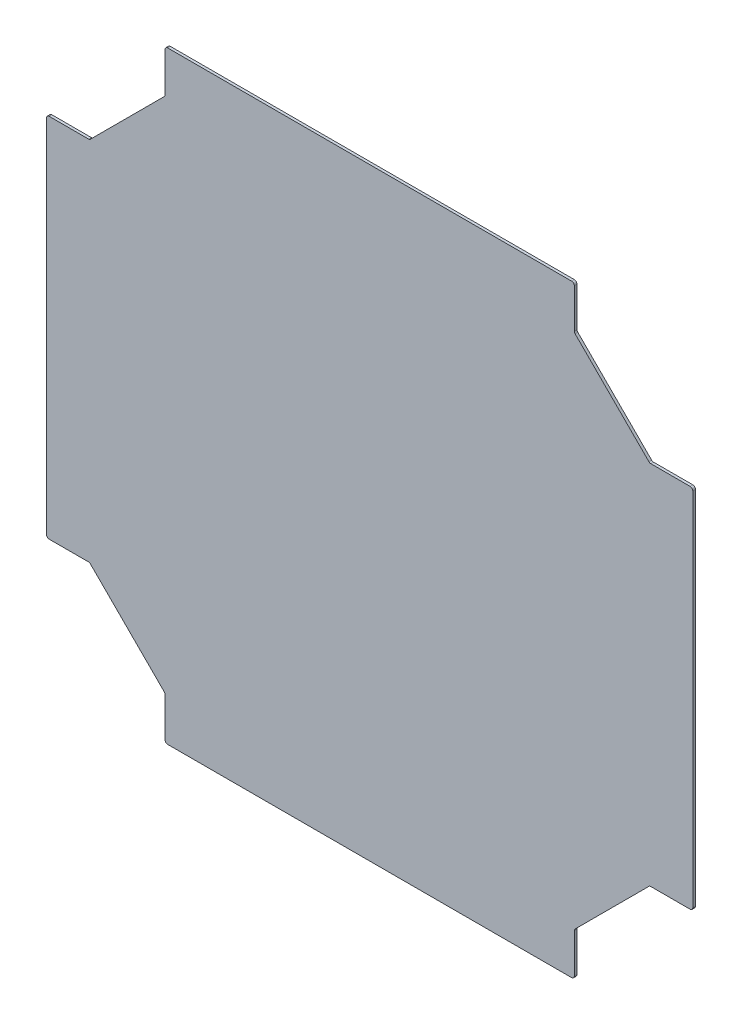
ISO-10303-21;
HEADER;
FILE_DESCRIPTION(('STEP AP214'),'2;1');
FILE_NAME('part.step','',(''),(''),'','','');
FILE_SCHEMA(('AUTOMOTIVE_DESIGN { 1 0 10303 214 1 1 1 1 }'));
ENDSEC;
DATA;
#1=APPLICATION_CONTEXT('core data for automotive mechanical design processes');
#2=APPLICATION_PROTOCOL_DEFINITION('international standard','automotive_design',2000,#1);
#3=PRODUCT_CONTEXT('',#1,'mechanical');
#4=PRODUCT('Part','Part','',(#3));
#5=PRODUCT_RELATED_PRODUCT_CATEGORY('part','',(#4));
#6=PRODUCT_DEFINITION_FORMATION('','',#4);
#7=PRODUCT_DEFINITION_CONTEXT('part definition',#1,'design');
#8=PRODUCT_DEFINITION('design','',#6,#7);
#9=PRODUCT_DEFINITION_SHAPE('','',#8);
#10=(LENGTH_UNIT() NAMED_UNIT(*) SI_UNIT(.MILLI.,.METRE.));
#11=(NAMED_UNIT(*) PLANE_ANGLE_UNIT() SI_UNIT($,.RADIAN.));
#12=(NAMED_UNIT(*) SI_UNIT($,.STERADIAN.) SOLID_ANGLE_UNIT());
#13=UNCERTAINTY_MEASURE_WITH_UNIT(LENGTH_MEASURE(1.E-05),#10,'distance_accuracy_value','');
#14=(GEOMETRIC_REPRESENTATION_CONTEXT(3) GLOBAL_UNCERTAINTY_ASSIGNED_CONTEXT((#13)) GLOBAL_UNIT_ASSIGNED_CONTEXT((#10,
#11,#12)) REPRESENTATION_CONTEXT('',''));
#15=CARTESIAN_POINT('',(0.,0.,0.));
#16=DIRECTION('',(0.,0.,1.));
#17=DIRECTION('',(1.,0.,0.));
#18=AXIS2_PLACEMENT_3D('',#15,#16,#17);
#19=CARTESIAN_POINT('',(0.,0.,3.175));
#20=DIRECTION('',(1.,0.,0.));
#21=DIRECTION('',(0.,0.,-1.));
#22=AXIS2_PLACEMENT_3D('',#19,#20,#21);
#23=PLANE('',#22);
#24=DIRECTION('',(0.,-1.,0.));
#25=VECTOR('',#24,1.);
#26=CARTESIAN_POINT('',(0.,0.,0.));
#27=LINE('',#26,#25);
#28=CARTESIAN_POINT('',(0.,568.325,0.));
#29=VERTEX_POINT('',#28);
#30=CARTESIAN_POINT('',(0.,142.875,0.));
#31=VERTEX_POINT('',#30);
#32=EDGE_CURVE('E247',#29,#31,#27,.T.);
#33=ORIENTED_EDGE('',*,*,#32,.T.);
#34=DIRECTION('',(0.,0.,1.));
#35=VECTOR('',#34,1.);
#36=CARTESIAN_POINT('',(0.,142.875,3.175));
#37=LINE('',#36,#35);
#38=CARTESIAN_POINT('',(0.,142.875,3.175));
#39=VERTEX_POINT('',#38);
#40=EDGE_CURVE('E253',#31,#39,#37,.T.);
#41=ORIENTED_EDGE('',*,*,#40,.T.);
#42=DIRECTION('',(0.,-1.,0.));
#43=VECTOR('',#42,1.);
#44=CARTESIAN_POINT('',(0.,0.,3.175));
#45=LINE('',#44,#43);
#46=CARTESIAN_POINT('',(0.,568.325,3.175));
#47=VERTEX_POINT('',#46);
#48=EDGE_CURVE('E250',#47,#39,#45,.T.);
#49=ORIENTED_EDGE('',*,*,#48,.F.);
#50=DIRECTION('',(0.,0.,1.));
#51=VECTOR('',#50,1.);
#52=CARTESIAN_POINT('',(0.,568.325,3.175));
#53=LINE('',#52,#51);
#54=EDGE_CURVE('E244',#47,#29,#53,.F.);
#55=ORIENTED_EDGE('',*,*,#54,.T.);
#56=EDGE_LOOP('',(#33,#41,#49,#55));
#57=FACE_BOUND('',#56,.T.);
#58=ADVANCED_FACE('F33',(#57),#23,.F.);
#59=CARTESIAN_POINT('',(0.,0.,3.175));
#60=DIRECTION('',(0.,1.,0.));
#61=DIRECTION('',(0.,0.,1.));
#62=AXIS2_PLACEMENT_3D('',#59,#60,#61);
#63=PLANE('',#62);
#64=DIRECTION('',(1.,0.,0.));
#65=VECTOR('',#64,1.);
#66=CARTESIAN_POINT('',(0.,0.,3.175));
#67=LINE('',#66,#65);
#68=CARTESIAN_POINT('',(142.875,0.,3.175));
#69=VERTEX_POINT('',#68);
#70=CARTESIAN_POINT('',(619.125,0.,3.175));
#71=VERTEX_POINT('',#70);
#72=EDGE_CURVE('E439',#69,#71,#67,.T.);
#73=ORIENTED_EDGE('',*,*,#72,.F.);
#74=DIRECTION('',(0.,0.,1.));
#75=VECTOR('',#74,1.);
#76=CARTESIAN_POINT('',(142.875,0.,3.175));
#77=LINE('',#76,#75);
#78=CARTESIAN_POINT('',(142.875,0.,0.));
#79=VERTEX_POINT('',#78);
#80=EDGE_CURVE('E300',#69,#79,#77,.F.);
#81=ORIENTED_EDGE('',*,*,#80,.T.);
#82=DIRECTION('',(1.,0.,0.));
#83=VECTOR('',#82,1.);
#84=CARTESIAN_POINT('',(0.,0.,0.));
#85=LINE('',#84,#83);
#86=CARTESIAN_POINT('',(619.125,0.,0.));
#87=VERTEX_POINT('',#86);
#88=EDGE_CURVE('E263',#79,#87,#85,.T.);
#89=ORIENTED_EDGE('',*,*,#88,.T.);
#90=DIRECTION('',(0.,0.,1.));
#91=VECTOR('',#90,1.);
#92=CARTESIAN_POINT('',(619.125,0.,3.175));
#93=LINE('',#92,#91);
#94=EDGE_CURVE('E297',#87,#71,#93,.T.);
#95=ORIENTED_EDGE('',*,*,#94,.T.);
#96=EDGE_LOOP('',(#73,#81,#89,#95));
#97=FACE_BOUND('',#96,.T.);
#98=ADVANCED_FACE('F523',(#97),#63,.F.);
#99=CARTESIAN_POINT('',(762.,0.,3.175));
#100=DIRECTION('',(-1.,0.,0.));
#101=DIRECTION('',(0.,-1.,0.));
#102=AXIS2_PLACEMENT_3D('',#99,#100,#101);
#103=PLANE('',#102);
#104=DIRECTION('',(0.,1.,0.));
#105=VECTOR('',#104,1.);
#106=CARTESIAN_POINT('',(762.,0.,3.175));
#107=LINE('',#106,#105);
#108=CARTESIAN_POINT('',(762.,142.875,3.175));
#109=VERTEX_POINT('',#108);
#110=CARTESIAN_POINT('',(762.,568.325,3.175));
#111=VERTEX_POINT('',#110);
#112=EDGE_CURVE('E443',#109,#111,#107,.T.);
#113=ORIENTED_EDGE('',*,*,#112,.F.);
#114=DIRECTION('',(0.,0.,1.));
#115=VECTOR('',#114,1.);
#116=CARTESIAN_POINT('',(762.,142.875,3.175));
#117=LINE('',#116,#115);
#118=CARTESIAN_POINT('',(762.,142.875,0.));
#119=VERTEX_POINT('',#118);
#120=EDGE_CURVE('E320',#109,#119,#117,.F.);
#121=ORIENTED_EDGE('',*,*,#120,.T.);
#122=DIRECTION('',(0.,1.,0.));
#123=VECTOR('',#122,1.);
#124=CARTESIAN_POINT('',(762.,0.,0.));
#125=LINE('',#124,#123);
#126=CARTESIAN_POINT('',(762.,568.325,0.));
#127=VERTEX_POINT('',#126);
#128=EDGE_CURVE('E450',#119,#127,#125,.T.);
#129=ORIENTED_EDGE('',*,*,#128,.T.);
#130=DIRECTION('',(0.,0.,1.));
#131=VECTOR('',#130,1.);
#132=CARTESIAN_POINT('',(762.,568.325,3.175));
#133=LINE('',#132,#131);
#134=EDGE_CURVE('E317',#127,#111,#133,.T.);
#135=ORIENTED_EDGE('',*,*,#134,.T.);
#136=EDGE_LOOP('',(#113,#121,#129,#135));
#137=FACE_BOUND('',#136,.T.);
#138=ADVANCED_FACE('F560',(#137),#103,.F.);
#139=CARTESIAN_POINT('',(0.,711.2,3.175));
#140=DIRECTION('',(0.,-1.,0.));
#141=DIRECTION('',(1.,0.,0.));
#142=AXIS2_PLACEMENT_3D('',#139,#140,#141);
#143=PLANE('',#142);
#144=DIRECTION('',(-1.,0.,0.));
#145=VECTOR('',#144,1.);
#146=CARTESIAN_POINT('',(0.,711.2,3.175));
#147=LINE('',#146,#145);
#148=CARTESIAN_POINT('',(619.125,711.2,3.175));
#149=VERTEX_POINT('',#148);
#150=CARTESIAN_POINT('',(142.875,711.2,3.175));
#151=VERTEX_POINT('',#150);
#152=EDGE_CURVE('E254',#149,#151,#147,.T.);
#153=ORIENTED_EDGE('',*,*,#152,.F.);
#154=DIRECTION('',(0.,0.,1.));
#155=VECTOR('',#154,1.);
#156=CARTESIAN_POINT('',(619.125,711.2,3.175));
#157=LINE('',#156,#155);
#158=CARTESIAN_POINT('',(619.125,711.2,0.));
#159=VERTEX_POINT('',#158);
#160=EDGE_CURVE('E55',#149,#159,#157,.F.);
#161=ORIENTED_EDGE('',*,*,#160,.T.);
#162=DIRECTION('',(-1.,0.,0.));
#163=VECTOR('',#162,1.);
#164=CARTESIAN_POINT('',(0.,711.2,0.));
#165=LINE('',#164,#163);
#166=CARTESIAN_POINT('',(142.875,711.2,0.));
#167=VERTEX_POINT('',#166);
#168=EDGE_CURVE('E440',#159,#167,#165,.T.);
#169=ORIENTED_EDGE('',*,*,#168,.T.);
#170=DIRECTION('',(0.,0.,1.));
#171=VECTOR('',#170,1.);
#172=CARTESIAN_POINT('',(142.875,711.2,3.175));
#173=LINE('',#172,#171);
#174=EDGE_CURVE('E350',#167,#151,#173,.T.);
#175=ORIENTED_EDGE('',*,*,#174,.T.);
#176=EDGE_LOOP('',(#153,#161,#169,#175));
#177=FACE_BOUND('',#176,.T.);
#178=ADVANCED_FACE('F598',(#177),#143,.F.);
#179=CARTESIAN_POINT('',(0.,0.,3.175));
#180=DIRECTION('',(0.,0.,-1.));
#181=DIRECTION('',(-1.,0.,0.));
#182=AXIS2_PLACEMENT_3D('',#179,#180,#181);
#183=PLANE('',#182);
#184=ORIENTED_EDGE('',*,*,#48,.T.);
#185=CARTESIAN_POINT('',(3.175,142.875,3.175));
#186=DIRECTION('',(0.,0.,-1.));
#187=DIRECTION('',(-1.,0.,0.));
#188=AXIS2_PLACEMENT_3D('',#185,#186,#187);
#189=CIRCLE('',#188,3.175);
#190=CARTESIAN_POINT('',(3.175,139.7,3.175));
#191=VERTEX_POINT('',#190);
#192=EDGE_CURVE('E469',#39,#191,#189,.F.);
#193=ORIENTED_EDGE('',*,*,#192,.T.);
#194=DIRECTION('',(-1.,0.,0.));
#195=VECTOR('',#194,1.);
#196=CARTESIAN_POINT('',(0.,139.7,3.175));
#197=LINE('',#196,#195);
#198=CARTESIAN_POINT('',(49.4848719394655,139.7,3.175));
#199=VERTEX_POINT('',#198);
#200=EDGE_CURVE('E477',#199,#191,#197,.T.);
#201=ORIENTED_EDGE('',*,*,#200,.F.);
#202=CARTESIAN_POINT('',(49.4848719394655,136.525,3.175));
#203=DIRECTION('',(0.,0.,-1.));
#204=DIRECTION('',(-1.,0.,0.));
#205=AXIS2_PLACEMENT_3D('',#202,#203,#204);
#206=CIRCLE('',#205,3.175);
#207=CARTESIAN_POINT('',(51.7299359697328,138.770064030267,3.175));
#208=VERTEX_POINT('',#207);
#209=EDGE_CURVE('E354',#199,#208,#206,.T.);
#210=ORIENTED_EDGE('',*,*,#209,.T.);
#211=DIRECTION('',(-0.707106781186547,0.707106781186548,0.));
#212=VECTOR('',#211,1.);
#213=CARTESIAN_POINT('',(50.8,139.7,3.175));
#214=LINE('',#213,#212);
#215=CARTESIAN_POINT('',(138.770064030267,51.7299359697327,3.175));
#216=VERTEX_POINT('',#215);
#217=EDGE_CURVE('E485',#216,#208,#214,.T.);
#218=ORIENTED_EDGE('',*,*,#217,.F.);
#219=CARTESIAN_POINT('',(136.525,49.4848719394654,3.175));
#220=DIRECTION('',(0.,0.,-1.));
#221=DIRECTION('',(-1.,0.,0.));
#222=AXIS2_PLACEMENT_3D('',#219,#220,#221);
#223=CIRCLE('',#222,3.175);
#224=CARTESIAN_POINT('',(139.7,49.4848719394654,3.175));
#225=VERTEX_POINT('',#224);
#226=EDGE_CURVE('E358',#216,#225,#223,.T.);
#227=ORIENTED_EDGE('',*,*,#226,.T.);
#228=DIRECTION('',(0.,1.,0.));
#229=VECTOR('',#228,1.);
#230=CARTESIAN_POINT('',(139.7,50.8,3.175));
#231=LINE('',#230,#229);
#232=CARTESIAN_POINT('',(139.7,3.175,3.175));
#233=VERTEX_POINT('',#232);
#234=EDGE_CURVE('E484',#233,#225,#231,.T.);
#235=ORIENTED_EDGE('',*,*,#234,.F.);
#236=CARTESIAN_POINT('',(142.875,3.175,3.175));
#237=DIRECTION('',(0.,0.,-1.));
#238=DIRECTION('',(-1.,0.,0.));
#239=AXIS2_PLACEMENT_3D('',#236,#237,#238);
#240=CIRCLE('',#239,3.175);
#241=EDGE_CURVE('E467',#233,#69,#240,.F.);
#242=ORIENTED_EDGE('',*,*,#241,.T.);
#243=ORIENTED_EDGE('',*,*,#72,.T.);
#244=CARTESIAN_POINT('',(619.125,3.175,3.175));
#245=DIRECTION('',(0.,0.,-1.));
#246=DIRECTION('',(-1.,0.,0.));
#247=AXIS2_PLACEMENT_3D('',#244,#245,#246);
#248=CIRCLE('',#247,3.175);
#249=CARTESIAN_POINT('',(622.3,3.175,3.175));
#250=VERTEX_POINT('',#249);
#251=EDGE_CURVE('E465',#71,#250,#248,.F.);
#252=ORIENTED_EDGE('',*,*,#251,.T.);
#253=DIRECTION('',(0.,-1.,0.));
#254=VECTOR('',#253,1.);
#255=CARTESIAN_POINT('',(622.3,50.8,3.175));
#256=LINE('',#255,#254);
#257=CARTESIAN_POINT('',(622.3,49.4848719394655,3.175));
#258=VERTEX_POINT('',#257);
#259=EDGE_CURVE('E414',#258,#250,#256,.T.);
#260=ORIENTED_EDGE('',*,*,#259,.F.);
#261=CARTESIAN_POINT('',(625.475,49.4848719394655,3.175));
#262=DIRECTION('',(0.,0.,-1.));
#263=DIRECTION('',(-1.,0.,0.));
#264=AXIS2_PLACEMENT_3D('',#261,#262,#263);
#265=CIRCLE('',#264,3.175);
#266=CARTESIAN_POINT('',(623.229935969733,51.7299359697327,3.175));
#267=VERTEX_POINT('',#266);
#268=EDGE_CURVE('E362',#258,#267,#265,.T.);
#269=ORIENTED_EDGE('',*,*,#268,.T.);
#270=DIRECTION('',(-0.707106781186548,-0.707106781186548,0.));
#271=VECTOR('',#270,1.);
#272=CARTESIAN_POINT('',(711.2,139.7,3.175));
#273=LINE('',#272,#271);
#274=CARTESIAN_POINT('',(710.270064030267,138.770064030267,3.175));
#275=VERTEX_POINT('',#274);
#276=EDGE_CURVE('E503',#275,#267,#273,.T.);
#277=ORIENTED_EDGE('',*,*,#276,.F.);
#278=CARTESIAN_POINT('',(712.515128060535,136.525,3.175));
#279=DIRECTION('',(0.,0.,-1.));
#280=DIRECTION('',(-1.,0.,0.));
#281=AXIS2_PLACEMENT_3D('',#278,#279,#280);
#282=CIRCLE('',#281,3.175);
#283=CARTESIAN_POINT('',(712.515128060535,139.7,3.175));
#284=VERTEX_POINT('',#283);
#285=EDGE_CURVE('E366',#275,#284,#282,.T.);
#286=ORIENTED_EDGE('',*,*,#285,.T.);
#287=DIRECTION('',(-1.,0.,0.));
#288=VECTOR('',#287,1.);
#289=CARTESIAN_POINT('',(762.,139.7,3.175));
#290=LINE('',#289,#288);
#291=CARTESIAN_POINT('',(758.825,139.7,3.175));
#292=VERTEX_POINT('',#291);
#293=EDGE_CURVE('E418',#292,#284,#290,.T.);
#294=ORIENTED_EDGE('',*,*,#293,.F.);
#295=CARTESIAN_POINT('',(758.825,142.875,3.175));
#296=DIRECTION('',(0.,0.,-1.));
#297=DIRECTION('',(-1.,0.,0.));
#298=AXIS2_PLACEMENT_3D('',#295,#296,#297);
#299=CIRCLE('',#298,3.175);
#300=EDGE_CURVE('E463',#292,#109,#299,.F.);
#301=ORIENTED_EDGE('',*,*,#300,.T.);
#302=ORIENTED_EDGE('',*,*,#112,.T.);
#303=CARTESIAN_POINT('',(758.825,568.325,3.175));
#304=DIRECTION('',(0.,0.,-1.));
#305=DIRECTION('',(-1.,0.,0.));
#306=AXIS2_PLACEMENT_3D('',#303,#304,#305);
#307=CIRCLE('',#306,3.175);
#308=CARTESIAN_POINT('',(758.825,571.5,3.175));
#309=VERTEX_POINT('',#308);
#310=EDGE_CURVE('E461',#111,#309,#307,.F.);
#311=ORIENTED_EDGE('',*,*,#310,.T.);
#312=DIRECTION('',(1.,0.,0.));
#313=VECTOR('',#312,1.);
#314=CARTESIAN_POINT('',(762.,571.5,3.175));
#315=LINE('',#314,#313);
#316=CARTESIAN_POINT('',(712.515128060534,571.5,3.175));
#317=VERTEX_POINT('',#316);
#318=EDGE_CURVE('E398',#317,#309,#315,.T.);
#319=ORIENTED_EDGE('',*,*,#318,.F.);
#320=CARTESIAN_POINT('',(712.515128060534,574.675,3.175));
#321=DIRECTION('',(0.,0.,-1.));
#322=DIRECTION('',(-1.,0.,0.));
#323=AXIS2_PLACEMENT_3D('',#320,#321,#322);
#324=CIRCLE('',#323,3.175);
#325=CARTESIAN_POINT('',(710.270064030267,572.429935969733,3.175));
#326=VERTEX_POINT('',#325);
#327=EDGE_CURVE('E370',#317,#326,#324,.T.);
#328=ORIENTED_EDGE('',*,*,#327,.T.);
#329=DIRECTION('',(0.707106781186547,-0.707106781186548,0.));
#330=VECTOR('',#329,1.);
#331=CARTESIAN_POINT('',(711.2,571.5,3.175));
#332=LINE('',#331,#330);
#333=CARTESIAN_POINT('',(623.229935969733,659.470064030267,3.175));
#334=VERTEX_POINT('',#333);
#335=EDGE_CURVE('E388',#334,#326,#332,.T.);
#336=ORIENTED_EDGE('',*,*,#335,.F.);
#337=CARTESIAN_POINT('',(625.475,661.715128060534,3.175));
#338=DIRECTION('',(0.,0.,-1.));
#339=DIRECTION('',(-1.,0.,0.));
#340=AXIS2_PLACEMENT_3D('',#337,#338,#339);
#341=CIRCLE('',#340,3.175);
#342=CARTESIAN_POINT('',(622.3,661.715128060534,3.175));
#343=VERTEX_POINT('',#342);
#344=EDGE_CURVE('E41',#334,#343,#341,.T.);
#345=ORIENTED_EDGE('',*,*,#344,.T.);
#346=DIRECTION('',(0.,-1.,0.));
#347=VECTOR('',#346,1.);
#348=CARTESIAN_POINT('',(622.3,660.4,3.175));
#349=LINE('',#348,#347);
#350=CARTESIAN_POINT('',(622.3,708.025,3.175));
#351=VERTEX_POINT('',#350);
#352=EDGE_CURVE('E386',#351,#343,#349,.T.);
#353=ORIENTED_EDGE('',*,*,#352,.F.);
#354=CARTESIAN_POINT('',(619.125,708.025,3.175));
#355=DIRECTION('',(0.,0.,-1.));
#356=DIRECTION('',(-1.,0.,0.));
#357=AXIS2_PLACEMENT_3D('',#354,#355,#356);
#358=CIRCLE('',#357,3.175);
#359=EDGE_CURVE('E459',#351,#149,#358,.F.);
#360=ORIENTED_EDGE('',*,*,#359,.T.);
#361=ORIENTED_EDGE('',*,*,#152,.T.);
#362=CARTESIAN_POINT('',(142.875,708.025,3.175));
#363=DIRECTION('',(0.,0.,-1.));
#364=DIRECTION('',(-1.,0.,0.));
#365=AXIS2_PLACEMENT_3D('',#362,#363,#364);
#366=CIRCLE('',#365,3.175);
#367=CARTESIAN_POINT('',(139.7,708.025,3.175));
#368=VERTEX_POINT('',#367);
#369=EDGE_CURVE('E457',#151,#368,#366,.F.);
#370=ORIENTED_EDGE('',*,*,#369,.T.);
#371=DIRECTION('',(0.,1.,0.));
#372=VECTOR('',#371,1.);
#373=CARTESIAN_POINT('',(139.7,660.4,3.175));
#374=LINE('',#373,#372);
#375=CARTESIAN_POINT('',(139.7,661.715128060534,3.175));
#376=VERTEX_POINT('',#375);
#377=EDGE_CURVE('E425',#376,#368,#374,.T.);
#378=ORIENTED_EDGE('',*,*,#377,.F.);
#379=CARTESIAN_POINT('',(136.525,661.715128060534,3.175));
#380=DIRECTION('',(0.,0.,-1.));
#381=DIRECTION('',(-1.,0.,0.));
#382=AXIS2_PLACEMENT_3D('',#379,#380,#381);
#383=CIRCLE('',#382,3.175);
#384=CARTESIAN_POINT('',(138.770064030267,659.470064030267,3.175));
#385=VERTEX_POINT('',#384);
#386=EDGE_CURVE('E374',#376,#385,#383,.T.);
#387=ORIENTED_EDGE('',*,*,#386,.T.);
#388=DIRECTION('',(0.707106781186547,0.707106781186548,0.));
#389=VECTOR('',#388,1.);
#390=CARTESIAN_POINT('',(50.8,571.5,3.175));
#391=LINE('',#390,#389);
#392=CARTESIAN_POINT('',(51.7299359697328,572.429935969733,3.175));
#393=VERTEX_POINT('',#392);
#394=EDGE_CURVE('E432',#393,#385,#391,.T.);
#395=ORIENTED_EDGE('',*,*,#394,.F.);
#396=CARTESIAN_POINT('',(49.4848719394655,574.675,3.175));
#397=DIRECTION('',(0.,0.,-1.));
#398=DIRECTION('',(-1.,0.,0.));
#399=AXIS2_PLACEMENT_3D('',#396,#397,#398);
#400=CIRCLE('',#399,3.175);
#401=CARTESIAN_POINT('',(49.4848719394655,571.5,3.175));
#402=VERTEX_POINT('',#401);
#403=EDGE_CURVE('E378',#393,#402,#400,.T.);
#404=ORIENTED_EDGE('',*,*,#403,.T.);
#405=DIRECTION('',(1.,0.,0.));
#406=VECTOR('',#405,1.);
#407=CARTESIAN_POINT('',(0.,571.5,3.175));
#408=LINE('',#407,#406);
#409=CARTESIAN_POINT('',(3.175,571.5,3.175));
#410=VERTEX_POINT('',#409);
#411=EDGE_CURVE('E429',#410,#402,#408,.T.);
#412=ORIENTED_EDGE('',*,*,#411,.F.);
#413=CARTESIAN_POINT('',(3.175,568.325,3.175));
#414=DIRECTION('',(0.,0.,-1.));
#415=DIRECTION('',(-1.,0.,0.));
#416=AXIS2_PLACEMENT_3D('',#413,#414,#415);
#417=CIRCLE('',#416,3.175);
#418=EDGE_CURVE('E455',#410,#47,#417,.F.);
#419=ORIENTED_EDGE('',*,*,#418,.T.);
#420=EDGE_LOOP('',(#184,#193,#201,#210,#218,#227,#235,#242,#243,#252,#260,#269,#277,#286,#294,
#301,#302,#311,#319,#328,#336,#345,#353,#360,#361,#370,#378,#387,#395,#404,#412,#419));
#421=FACE_BOUND('',#420,.T.);
#422=ADVANCED_FACE('F385',(#421),#183,.F.);
#423=CARTESIAN_POINT('',(0.,0.,0.));
#424=DIRECTION('',(0.,0.,-1.));
#425=DIRECTION('',(-1.,0.,0.));
#426=AXIS2_PLACEMENT_3D('',#423,#424,#425);
#427=PLANE('',#426);
#428=DIRECTION('',(-1.,0.,0.));
#429=VECTOR('',#428,1.);
#430=CARTESIAN_POINT('',(0.,139.7,0.));
#431=LINE('',#430,#429);
#432=CARTESIAN_POINT('',(49.4848719394655,139.7,0.));
#433=VERTEX_POINT('',#432);
#434=CARTESIAN_POINT('',(3.175,139.7,0.));
#435=VERTEX_POINT('',#434);
#436=EDGE_CURVE('E479',#433,#435,#431,.T.);
#437=ORIENTED_EDGE('',*,*,#436,.T.);
#438=CARTESIAN_POINT('',(3.175,142.875,0.));
#439=DIRECTION('',(0.,0.,-1.));
#440=DIRECTION('',(-1.,0.,0.));
#441=AXIS2_PLACEMENT_3D('',#438,#439,#440);
#442=CIRCLE('',#441,3.175);
#443=EDGE_CURVE('E262',#435,#31,#442,.T.);
#444=ORIENTED_EDGE('',*,*,#443,.T.);
#445=ORIENTED_EDGE('',*,*,#32,.F.);
#446=CARTESIAN_POINT('',(3.175,568.325,0.));
#447=DIRECTION('',(0.,0.,-1.));
#448=DIRECTION('',(-1.,0.,0.));
#449=AXIS2_PLACEMENT_3D('',#446,#447,#448);
#450=CIRCLE('',#449,3.175);
#451=CARTESIAN_POINT('',(3.175,571.5,0.));
#452=VERTEX_POINT('',#451);
#453=EDGE_CURVE('E259',#29,#452,#450,.T.);
#454=ORIENTED_EDGE('',*,*,#453,.T.);
#455=DIRECTION('',(1.,0.,0.));
#456=VECTOR('',#455,1.);
#457=CARTESIAN_POINT('',(0.,571.5,0.));
#458=LINE('',#457,#456);
#459=CARTESIAN_POINT('',(49.4848719394655,571.5,0.));
#460=VERTEX_POINT('',#459);
#461=EDGE_CURVE('E422',#452,#460,#458,.T.);
#462=ORIENTED_EDGE('',*,*,#461,.T.);
#463=CARTESIAN_POINT('',(49.4848719394655,574.675,0.));
#464=DIRECTION('',(0.,0.,-1.));
#465=DIRECTION('',(-1.,0.,0.));
#466=AXIS2_PLACEMENT_3D('',#463,#464,#465);
#467=CIRCLE('',#466,3.175);
#468=CARTESIAN_POINT('',(51.7299359697328,572.429935969733,0.));
#469=VERTEX_POINT('',#468);
#470=EDGE_CURVE('E380',#460,#469,#467,.F.);
#471=ORIENTED_EDGE('',*,*,#470,.T.);
#472=DIRECTION('',(0.707106781186547,0.707106781186548,0.));
#473=VECTOR('',#472,1.);
#474=CARTESIAN_POINT('',(50.8,571.5,0.));
#475=LINE('',#474,#473);
#476=CARTESIAN_POINT('',(138.770064030267,659.470064030267,0.));
#477=VERTEX_POINT('',#476);
#478=EDGE_CURVE('E424',#469,#477,#475,.T.);
#479=ORIENTED_EDGE('',*,*,#478,.T.);
#480=CARTESIAN_POINT('',(136.525,661.715128060534,0.));
#481=DIRECTION('',(0.,0.,-1.));
#482=DIRECTION('',(-1.,0.,0.));
#483=AXIS2_PLACEMENT_3D('',#480,#481,#482);
#484=CIRCLE('',#483,3.175);
#485=CARTESIAN_POINT('',(139.7,661.715128060534,0.));
#486=VERTEX_POINT('',#485);
#487=EDGE_CURVE('E376',#477,#486,#484,.F.);
#488=ORIENTED_EDGE('',*,*,#487,.T.);
#489=DIRECTION('',(0.,1.,0.));
#490=VECTOR('',#489,1.);
#491=CARTESIAN_POINT('',(139.7,660.4,0.));
#492=LINE('',#491,#490);
#493=CARTESIAN_POINT('',(139.7,708.025,0.));
#494=VERTEX_POINT('',#493);
#495=EDGE_CURVE('E264',#486,#494,#492,.T.);
#496=ORIENTED_EDGE('',*,*,#495,.T.);
#497=CARTESIAN_POINT('',(142.875,708.025,0.));
#498=DIRECTION('',(0.,0.,-1.));
#499=DIRECTION('',(-1.,0.,0.));
#500=AXIS2_PLACEMENT_3D('',#497,#498,#499);
#501=CIRCLE('',#500,3.175);
#502=EDGE_CURVE('E48',#494,#167,#501,.T.);
#503=ORIENTED_EDGE('',*,*,#502,.T.);
#504=ORIENTED_EDGE('',*,*,#168,.F.);
#505=CARTESIAN_POINT('',(619.125,708.025,0.));
#506=DIRECTION('',(0.,0.,-1.));
#507=DIRECTION('',(-1.,0.,0.));
#508=AXIS2_PLACEMENT_3D('',#505,#506,#507);
#509=CIRCLE('',#508,3.175);
#510=CARTESIAN_POINT('',(622.3,708.025,0.));
#511=VERTEX_POINT('',#510);
#512=EDGE_CURVE('E271',#159,#511,#509,.T.);
#513=ORIENTED_EDGE('',*,*,#512,.T.);
#514=DIRECTION('',(0.,-1.,0.));
#515=VECTOR('',#514,1.);
#516=CARTESIAN_POINT('',(622.3,660.4,0.));
#517=LINE('',#516,#515);
#518=CARTESIAN_POINT('',(622.3,661.715128060534,0.));
#519=VERTEX_POINT('',#518);
#520=EDGE_CURVE('E405',#511,#519,#517,.T.);
#521=ORIENTED_EDGE('',*,*,#520,.T.);
#522=CARTESIAN_POINT('',(625.475,661.715128060534,0.));
#523=DIRECTION('',(0.,0.,-1.));
#524=DIRECTION('',(-1.,0.,0.));
#525=AXIS2_PLACEMENT_3D('',#522,#523,#524);
#526=CIRCLE('',#525,3.175);
#527=CARTESIAN_POINT('',(623.229935969733,659.470064030267,0.));
#528=VERTEX_POINT('',#527);
#529=EDGE_CURVE('E11',#519,#528,#526,.F.);
#530=ORIENTED_EDGE('',*,*,#529,.T.);
#531=DIRECTION('',(0.707106781186547,-0.707106781186548,0.));
#532=VECTOR('',#531,1.);
#533=CARTESIAN_POINT('',(711.2,571.5,0.));
#534=LINE('',#533,#532);
#535=CARTESIAN_POINT('',(710.270064030267,572.429935969733,0.));
#536=VERTEX_POINT('',#535);
#537=EDGE_CURVE('E397',#528,#536,#534,.T.);
#538=ORIENTED_EDGE('',*,*,#537,.T.);
#539=CARTESIAN_POINT('',(712.515128060534,574.675,0.));
#540=DIRECTION('',(0.,0.,-1.));
#541=DIRECTION('',(-1.,0.,0.));
#542=AXIS2_PLACEMENT_3D('',#539,#540,#541);
#543=CIRCLE('',#542,3.175);
#544=CARTESIAN_POINT('',(712.515128060534,571.5,0.));
#545=VERTEX_POINT('',#544);
#546=EDGE_CURVE('E372',#536,#545,#543,.F.);
#547=ORIENTED_EDGE('',*,*,#546,.T.);
#548=DIRECTION('',(1.,0.,0.));
#549=VECTOR('',#548,1.);
#550=CARTESIAN_POINT('',(762.,571.5,0.));
#551=LINE('',#550,#549);
#552=CARTESIAN_POINT('',(758.825,571.5,0.));
#553=VERTEX_POINT('',#552);
#554=EDGE_CURVE('E409',#545,#553,#551,.T.);
#555=ORIENTED_EDGE('',*,*,#554,.T.);
#556=CARTESIAN_POINT('',(758.825,568.325,0.));
#557=DIRECTION('',(0.,0.,-1.));
#558=DIRECTION('',(-1.,0.,0.));
#559=AXIS2_PLACEMENT_3D('',#556,#557,#558);
#560=CIRCLE('',#559,3.175);
#561=EDGE_CURVE('E278',#553,#127,#560,.T.);
#562=ORIENTED_EDGE('',*,*,#561,.T.);
#563=ORIENTED_EDGE('',*,*,#128,.F.);
#564=CARTESIAN_POINT('',(758.825,142.875,0.));
#565=DIRECTION('',(0.,0.,-1.));
#566=DIRECTION('',(-1.,0.,0.));
#567=AXIS2_PLACEMENT_3D('',#564,#565,#566);
#568=CIRCLE('',#567,3.175);
#569=CARTESIAN_POINT('',(758.825,139.7,0.));
#570=VERTEX_POINT('',#569);
#571=EDGE_CURVE('E280',#119,#570,#568,.T.);
#572=ORIENTED_EDGE('',*,*,#571,.T.);
#573=DIRECTION('',(-1.,0.,0.));
#574=VECTOR('',#573,1.);
#575=CARTESIAN_POINT('',(762.,139.7,0.));
#576=LINE('',#575,#574);
#577=CARTESIAN_POINT('',(712.515128060535,139.7,0.));
#578=VERTEX_POINT('',#577);
#579=EDGE_CURVE('E494',#570,#578,#576,.T.);
#580=ORIENTED_EDGE('',*,*,#579,.T.);
#581=CARTESIAN_POINT('',(712.515128060535,136.525,0.));
#582=DIRECTION('',(0.,0.,-1.));
#583=DIRECTION('',(-1.,0.,0.));
#584=AXIS2_PLACEMENT_3D('',#581,#582,#583);
#585=CIRCLE('',#584,3.175);
#586=CARTESIAN_POINT('',(710.270064030267,138.770064030267,0.));
#587=VERTEX_POINT('',#586);
#588=EDGE_CURVE('E368',#578,#587,#585,.F.);
#589=ORIENTED_EDGE('',*,*,#588,.T.);
#590=DIRECTION('',(-0.707106781186548,-0.707106781186548,0.));
#591=VECTOR('',#590,1.);
#592=CARTESIAN_POINT('',(711.2,139.7,0.));
#593=LINE('',#592,#591);
#594=CARTESIAN_POINT('',(623.229935969733,51.7299359697327,0.));
#595=VERTEX_POINT('',#594);
#596=EDGE_CURVE('E497',#587,#595,#593,.T.);
#597=ORIENTED_EDGE('',*,*,#596,.T.);
#598=CARTESIAN_POINT('',(625.475,49.4848719394655,0.));
#599=DIRECTION('',(0.,0.,-1.));
#600=DIRECTION('',(-1.,0.,0.));
#601=AXIS2_PLACEMENT_3D('',#598,#599,#600);
#602=CIRCLE('',#601,3.175);
#603=CARTESIAN_POINT('',(622.3,49.4848719394655,0.));
#604=VERTEX_POINT('',#603);
#605=EDGE_CURVE('E364',#595,#604,#602,.F.);
#606=ORIENTED_EDGE('',*,*,#605,.T.);
#607=DIRECTION('',(0.,-1.,0.));
#608=VECTOR('',#607,1.);
#609=CARTESIAN_POINT('',(622.3,50.8,0.));
#610=LINE('',#609,#608);
#611=CARTESIAN_POINT('',(622.3,3.175,0.));
#612=VERTEX_POINT('',#611);
#613=EDGE_CURVE('E490',#604,#612,#610,.T.);
#614=ORIENTED_EDGE('',*,*,#613,.T.);
#615=CARTESIAN_POINT('',(619.125,3.175,0.));
#616=DIRECTION('',(0.,0.,-1.));
#617=DIRECTION('',(-1.,0.,0.));
#618=AXIS2_PLACEMENT_3D('',#615,#616,#617);
#619=CIRCLE('',#618,3.175);
#620=EDGE_CURVE('E282',#612,#87,#619,.T.);
#621=ORIENTED_EDGE('',*,*,#620,.T.);
#622=ORIENTED_EDGE('',*,*,#88,.F.);
#623=CARTESIAN_POINT('',(142.875,3.175,0.));
#624=DIRECTION('',(0.,0.,-1.));
#625=DIRECTION('',(-1.,0.,0.));
#626=AXIS2_PLACEMENT_3D('',#623,#624,#625);
#627=CIRCLE('',#626,3.175);
#628=CARTESIAN_POINT('',(139.7,3.175,0.));
#629=VERTEX_POINT('',#628);
#630=EDGE_CURVE('E284',#79,#629,#627,.T.);
#631=ORIENTED_EDGE('',*,*,#630,.T.);
#632=DIRECTION('',(0.,1.,0.));
#633=VECTOR('',#632,1.);
#634=CARTESIAN_POINT('',(139.7,50.8,0.));
#635=LINE('',#634,#633);
#636=CARTESIAN_POINT('',(139.7,49.4848719394654,0.));
#637=VERTEX_POINT('',#636);
#638=EDGE_CURVE('E433',#629,#637,#635,.T.);
#639=ORIENTED_EDGE('',*,*,#638,.T.);
#640=CARTESIAN_POINT('',(136.525,49.4848719394654,0.));
#641=DIRECTION('',(0.,0.,-1.));
#642=DIRECTION('',(-1.,0.,0.));
#643=AXIS2_PLACEMENT_3D('',#640,#641,#642);
#644=CIRCLE('',#643,3.175);
#645=CARTESIAN_POINT('',(138.770064030267,51.7299359697327,0.));
#646=VERTEX_POINT('',#645);
#647=EDGE_CURVE('E360',#637,#646,#644,.F.);
#648=ORIENTED_EDGE('',*,*,#647,.T.);
#649=DIRECTION('',(-0.707106781186547,0.707106781186548,0.));
#650=VECTOR('',#649,1.);
#651=CARTESIAN_POINT('',(50.8,139.7,0.));
#652=LINE('',#651,#650);
#653=CARTESIAN_POINT('',(51.7299359697328,138.770064030267,0.));
#654=VERTEX_POINT('',#653);
#655=EDGE_CURVE('E488',#646,#654,#652,.T.);
#656=ORIENTED_EDGE('',*,*,#655,.T.);
#657=CARTESIAN_POINT('',(49.4848719394655,136.525,0.));
#658=DIRECTION('',(0.,0.,-1.));
#659=DIRECTION('',(-1.,0.,0.));
#660=AXIS2_PLACEMENT_3D('',#657,#658,#659);
#661=CIRCLE('',#660,3.175);
#662=EDGE_CURVE('E356',#654,#433,#661,.F.);
#663=ORIENTED_EDGE('',*,*,#662,.T.);
#664=EDGE_LOOP('',(#437,#444,#445,#454,#462,#471,#479,#488,#496,#503,#504,#513,#521,#530,#538,
#547,#555,#562,#563,#572,#580,#589,#597,#606,#614,#621,#622,#631,#639,#648,#656,#663));
#665=FACE_BOUND('',#664,.T.);
#666=ADVANCED_FACE('F257',(#665),#427,.T.);
#667=CARTESIAN_POINT('',(139.7,660.4,0.));
#668=DIRECTION('',(1.,0.,0.));
#669=DIRECTION('',(0.,1.,0.));
#670=AXIS2_PLACEMENT_3D('',#667,#668,#669);
#671=PLANE('',#670);
#672=ORIENTED_EDGE('',*,*,#495,.F.);
#673=DIRECTION('',(0.,0.,1.));
#674=VECTOR('',#673,1.);
#675=CARTESIAN_POINT('',(139.7,661.715128060534,3.175));
#676=LINE('',#675,#674);
#677=EDGE_CURVE('E334',#486,#376,#676,.T.);
#678=ORIENTED_EDGE('',*,*,#677,.T.);
#679=ORIENTED_EDGE('',*,*,#377,.T.);
#680=DIRECTION('',(0.,0.,1.));
#681=VECTOR('',#680,1.);
#682=CARTESIAN_POINT('',(139.7,708.025,0.));
#683=LINE('',#682,#681);
#684=EDGE_CURVE('E332',#368,#494,#683,.F.);
#685=ORIENTED_EDGE('',*,*,#684,.T.);
#686=EDGE_LOOP('',(#672,#678,#679,#685));
#687=FACE_BOUND('',#686,.T.);
#688=ADVANCED_FACE('F593',(#687),#671,.F.);
#689=CARTESIAN_POINT('',(50.8,571.5,0.));
#690=DIRECTION('',(0.707106781186548,-0.707106781186547,0.));
#691=DIRECTION('',(0.707106781186547,0.707106781186548,0.));
#692=AXIS2_PLACEMENT_3D('',#689,#690,#691);
#693=PLANE('',#692);
#694=ORIENTED_EDGE('',*,*,#394,.T.);
#695=DIRECTION('',(0.,0.,1.));
#696=VECTOR('',#695,1.);
#697=CARTESIAN_POINT('',(138.770064030267,659.470064030267,0.));
#698=LINE('',#697,#696);
#699=EDGE_CURVE('E340',#385,#477,#698,.F.);
#700=ORIENTED_EDGE('',*,*,#699,.T.);
#701=ORIENTED_EDGE('',*,*,#478,.F.);
#702=DIRECTION('',(0.,0.,1.));
#703=VECTOR('',#702,1.);
#704=CARTESIAN_POINT('',(51.7299359697328,572.429935969733,3.175));
#705=LINE('',#704,#703);
#706=EDGE_CURVE('E337',#469,#393,#705,.T.);
#707=ORIENTED_EDGE('',*,*,#706,.T.);
#708=EDGE_LOOP('',(#694,#700,#701,#707));
#709=FACE_BOUND('',#708,.T.);
#710=ADVANCED_FACE('F584',(#709),#693,.F.);
#711=CARTESIAN_POINT('',(0.,571.5,0.));
#712=DIRECTION('',(0.,-1.,0.));
#713=DIRECTION('',(0.,0.,-1.));
#714=AXIS2_PLACEMENT_3D('',#711,#712,#713);
#715=PLANE('',#714);
#716=ORIENTED_EDGE('',*,*,#411,.T.);
#717=DIRECTION('',(0.,0.,1.));
#718=VECTOR('',#717,1.);
#719=CARTESIAN_POINT('',(49.4848719394655,571.5,0.));
#720=LINE('',#719,#718);
#721=EDGE_CURVE('E343',#402,#460,#720,.F.);
#722=ORIENTED_EDGE('',*,*,#721,.T.);
#723=ORIENTED_EDGE('',*,*,#461,.F.);
#724=DIRECTION('',(0.,0.,1.));
#725=VECTOR('',#724,1.);
#726=CARTESIAN_POINT('',(3.175,571.5,0.));
#727=LINE('',#726,#725);
#728=EDGE_CURVE('E268',#452,#410,#727,.T.);
#729=ORIENTED_EDGE('',*,*,#728,.T.);
#730=EDGE_LOOP('',(#716,#722,#723,#729));
#731=FACE_BOUND('',#730,.T.);
#732=ADVANCED_FACE('F575',(#731),#715,.F.);
#733=CARTESIAN_POINT('',(50.8,139.7,0.));
#734=DIRECTION('',(0.707106781186548,0.707106781186547,0.));
#735=DIRECTION('',(-0.707106781186547,0.707106781186548,0.));
#736=AXIS2_PLACEMENT_3D('',#733,#734,#735);
#737=PLANE('',#736);
#738=ORIENTED_EDGE('',*,*,#217,.T.);
#739=DIRECTION('',(0.,0.,1.));
#740=VECTOR('',#739,1.);
#741=CARTESIAN_POINT('',(51.7299359697328,138.770064030267,0.));
#742=LINE('',#741,#740);
#743=EDGE_CURVE('E290',#208,#654,#742,.F.);
#744=ORIENTED_EDGE('',*,*,#743,.T.);
#745=ORIENTED_EDGE('',*,*,#655,.F.);
#746=DIRECTION('',(0.,0.,1.));
#747=VECTOR('',#746,1.);
#748=CARTESIAN_POINT('',(138.770064030267,51.7299359697327,3.175));
#749=LINE('',#748,#747);
#750=EDGE_CURVE('E287',#646,#216,#749,.T.);
#751=ORIENTED_EDGE('',*,*,#750,.T.);
#752=EDGE_LOOP('',(#738,#744,#745,#751));
#753=FACE_BOUND('',#752,.T.);
#754=ADVANCED_FACE('F543',(#753),#737,.F.);
#755=CARTESIAN_POINT('',(139.7,50.8,0.));
#756=DIRECTION('',(1.,0.,0.));
#757=DIRECTION('',(0.,1.,0.));
#758=AXIS2_PLACEMENT_3D('',#755,#756,#757);
#759=PLANE('',#758);
#760=ORIENTED_EDGE('',*,*,#234,.T.);
#761=DIRECTION('',(0.,0.,1.));
#762=VECTOR('',#761,1.);
#763=CARTESIAN_POINT('',(139.7,49.4848719394654,0.));
#764=LINE('',#763,#762);
#765=EDGE_CURVE('E295',#225,#637,#764,.F.);
#766=ORIENTED_EDGE('',*,*,#765,.T.);
#767=ORIENTED_EDGE('',*,*,#638,.F.);
#768=DIRECTION('',(0.,0.,1.));
#769=VECTOR('',#768,1.);
#770=CARTESIAN_POINT('',(139.7,3.175,0.));
#771=LINE('',#770,#769);
#772=EDGE_CURVE('E292',#629,#233,#771,.T.);
#773=ORIENTED_EDGE('',*,*,#772,.T.);
#774=EDGE_LOOP('',(#760,#766,#767,#773));
#775=FACE_BOUND('',#774,.T.);
#776=ADVANCED_FACE('F532',(#775),#759,.F.);
#777=CARTESIAN_POINT('',(0.,139.7,0.));
#778=DIRECTION('',(0.,1.,0.));
#779=DIRECTION('',(0.,0.,1.));
#780=AXIS2_PLACEMENT_3D('',#777,#778,#779);
#781=PLANE('',#780);
#782=ORIENTED_EDGE('',*,*,#200,.T.);
#783=DIRECTION('',(0.,0.,1.));
#784=VECTOR('',#783,1.);
#785=CARTESIAN_POINT('',(3.175,139.7,0.));
#786=LINE('',#785,#784);
#787=EDGE_CURVE('E269',#191,#435,#786,.F.);
#788=ORIENTED_EDGE('',*,*,#787,.T.);
#789=ORIENTED_EDGE('',*,*,#436,.F.);
#790=DIRECTION('',(0.,0.,1.));
#791=VECTOR('',#790,1.);
#792=CARTESIAN_POINT('',(49.4848719394655,139.7,3.175));
#793=LINE('',#792,#791);
#794=EDGE_CURVE('E273',#433,#199,#793,.T.);
#795=ORIENTED_EDGE('',*,*,#794,.T.);
#796=EDGE_LOOP('',(#782,#788,#789,#795));
#797=FACE_BOUND('',#796,.T.);
#798=ADVANCED_FACE('F476',(#797),#781,.F.);
#799=CARTESIAN_POINT('',(622.3,50.8,0.));
#800=DIRECTION('',(-1.,0.,0.));
#801=DIRECTION('',(0.,0.,1.));
#802=AXIS2_PLACEMENT_3D('',#799,#800,#801);
#803=PLANE('',#802);
#804=ORIENTED_EDGE('',*,*,#259,.T.);
#805=DIRECTION('',(0.,0.,1.));
#806=VECTOR('',#805,1.);
#807=CARTESIAN_POINT('',(622.3,3.175,0.));
#808=LINE('',#807,#806);
#809=EDGE_CURVE('E305',#250,#612,#808,.F.);
#810=ORIENTED_EDGE('',*,*,#809,.T.);
#811=ORIENTED_EDGE('',*,*,#613,.F.);
#812=DIRECTION('',(0.,0.,1.));
#813=VECTOR('',#812,1.);
#814=CARTESIAN_POINT('',(622.3,49.4848719394655,3.175));
#815=LINE('',#814,#813);
#816=EDGE_CURVE('E302',#604,#258,#815,.T.);
#817=ORIENTED_EDGE('',*,*,#816,.T.);
#818=EDGE_LOOP('',(#804,#810,#811,#817));
#819=FACE_BOUND('',#818,.T.);
#820=ADVANCED_FACE('F512',(#819),#803,.F.);
#821=CARTESIAN_POINT('',(711.2,139.7,0.));
#822=DIRECTION('',(-0.707106781186548,0.707106781186548,0.));
#823=DIRECTION('',(-0.707106781186548,-0.707106781186548,0.));
#824=AXIS2_PLACEMENT_3D('',#821,#822,#823);
#825=PLANE('',#824);
#826=ORIENTED_EDGE('',*,*,#276,.T.);
#827=DIRECTION('',(0.,0.,1.));
#828=VECTOR('',#827,1.);
#829=CARTESIAN_POINT('',(623.229935969733,51.7299359697327,0.));
#830=LINE('',#829,#828);
#831=EDGE_CURVE('E310',#267,#595,#830,.F.);
#832=ORIENTED_EDGE('',*,*,#831,.T.);
#833=ORIENTED_EDGE('',*,*,#596,.F.);
#834=DIRECTION('',(0.,0.,1.));
#835=VECTOR('',#834,1.);
#836=CARTESIAN_POINT('',(710.270064030267,138.770064030267,3.175));
#837=LINE('',#836,#835);
#838=EDGE_CURVE('E307',#587,#275,#837,.T.);
#839=ORIENTED_EDGE('',*,*,#838,.T.);
#840=EDGE_LOOP('',(#826,#832,#833,#839));
#841=FACE_BOUND('',#840,.T.);
#842=ADVANCED_FACE('F750',(#841),#825,.F.);
#843=CARTESIAN_POINT('',(762.,139.7,0.));
#844=DIRECTION('',(0.,1.,0.));
#845=DIRECTION('',(-1.,0.,0.));
#846=AXIS2_PLACEMENT_3D('',#843,#844,#845);
#847=PLANE('',#846);
#848=ORIENTED_EDGE('',*,*,#293,.T.);
#849=DIRECTION('',(0.,0.,1.));
#850=VECTOR('',#849,1.);
#851=CARTESIAN_POINT('',(712.515128060535,139.7,0.));
#852=LINE('',#851,#850);
#853=EDGE_CURVE('E315',#284,#578,#852,.F.);
#854=ORIENTED_EDGE('',*,*,#853,.T.);
#855=ORIENTED_EDGE('',*,*,#579,.F.);
#856=DIRECTION('',(0.,0.,1.));
#857=VECTOR('',#856,1.);
#858=CARTESIAN_POINT('',(758.825,139.7,0.));
#859=LINE('',#858,#857);
#860=EDGE_CURVE('E312',#570,#292,#859,.T.);
#861=ORIENTED_EDGE('',*,*,#860,.T.);
#862=EDGE_LOOP('',(#848,#854,#855,#861));
#863=FACE_BOUND('',#862,.T.);
#864=ADVANCED_FACE('F742',(#863),#847,.F.);
#865=CARTESIAN_POINT('',(711.2,571.5,0.));
#866=DIRECTION('',(-0.707106781186548,-0.707106781186547,0.));
#867=DIRECTION('',(0.707106781186547,-0.707106781186548,0.));
#868=AXIS2_PLACEMENT_3D('',#865,#866,#867);
#869=PLANE('',#868);
#870=ORIENTED_EDGE('',*,*,#335,.T.);
#871=DIRECTION('',(0.,0.,1.));
#872=VECTOR('',#871,1.);
#873=CARTESIAN_POINT('',(710.270064030267,572.429935969733,0.));
#874=LINE('',#873,#872);
#875=EDGE_CURVE('E330',#326,#536,#874,.F.);
#876=ORIENTED_EDGE('',*,*,#875,.T.);
#877=ORIENTED_EDGE('',*,*,#537,.F.);
#878=DIRECTION('',(0.,0.,1.));
#879=VECTOR('',#878,1.);
#880=CARTESIAN_POINT('',(623.229935969733,659.470064030267,3.175));
#881=LINE('',#880,#879);
#882=EDGE_CURVE('E327',#528,#334,#881,.T.);
#883=ORIENTED_EDGE('',*,*,#882,.T.);
#884=EDGE_LOOP('',(#870,#876,#877,#883));
#885=FACE_BOUND('',#884,.T.);
#886=ADVANCED_FACE('F407',(#885),#869,.F.);
#887=CARTESIAN_POINT('',(622.3,660.4,0.));
#888=DIRECTION('',(-1.,0.,0.));
#889=DIRECTION('',(0.,0.,1.));
#890=AXIS2_PLACEMENT_3D('',#887,#888,#889);
#891=PLANE('',#890);
#892=ORIENTED_EDGE('',*,*,#352,.T.);
#893=DIRECTION('',(0.,0.,1.));
#894=VECTOR('',#893,1.);
#895=CARTESIAN_POINT('',(622.3,661.715128060534,0.));
#896=LINE('',#895,#894);
#897=EDGE_CURVE('E348',#343,#519,#896,.F.);
#898=ORIENTED_EDGE('',*,*,#897,.T.);
#899=ORIENTED_EDGE('',*,*,#520,.F.);
#900=DIRECTION('',(0.,0.,1.));
#901=VECTOR('',#900,1.);
#902=CARTESIAN_POINT('',(622.3,708.025,0.));
#903=LINE('',#902,#901);
#904=EDGE_CURVE('E345',#511,#351,#903,.T.);
#905=ORIENTED_EDGE('',*,*,#904,.T.);
#906=EDGE_LOOP('',(#892,#898,#899,#905));
#907=FACE_BOUND('',#906,.T.);
#908=ADVANCED_FACE('F393',(#907),#891,.F.);
#909=CARTESIAN_POINT('',(762.,571.5,0.));
#910=DIRECTION('',(0.,-1.,0.));
#911=DIRECTION('',(0.,0.,-1.));
#912=AXIS2_PLACEMENT_3D('',#909,#910,#911);
#913=PLANE('',#912);
#914=ORIENTED_EDGE('',*,*,#318,.T.);
#915=DIRECTION('',(0.,0.,1.));
#916=VECTOR('',#915,1.);
#917=CARTESIAN_POINT('',(758.825,571.5,0.));
#918=LINE('',#917,#916);
#919=EDGE_CURVE('E325',#309,#553,#918,.F.);
#920=ORIENTED_EDGE('',*,*,#919,.T.);
#921=ORIENTED_EDGE('',*,*,#554,.F.);
#922=DIRECTION('',(0.,0.,1.));
#923=VECTOR('',#922,1.);
#924=CARTESIAN_POINT('',(712.515128060534,571.5,3.175));
#925=LINE('',#924,#923);
#926=EDGE_CURVE('E322',#545,#317,#925,.T.);
#927=ORIENTED_EDGE('',*,*,#926,.T.);
#928=EDGE_LOOP('',(#914,#920,#921,#927));
#929=FACE_BOUND('',#928,.T.);
#930=ADVANCED_FACE('F565',(#929),#913,.F.);
#931=CARTESIAN_POINT('',(3.175,142.875,3.175));
#932=DIRECTION('',(0.,0.,1.));
#933=DIRECTION('',(1.,0.,0.));
#934=AXIS2_PLACEMENT_3D('',#931,#932,#933);
#935=CYLINDRICAL_SURFACE('',#934,3.175);
#936=ORIENTED_EDGE('',*,*,#443,.F.);
#937=ORIENTED_EDGE('',*,*,#787,.F.);
#938=ORIENTED_EDGE('',*,*,#192,.F.);
#939=ORIENTED_EDGE('',*,*,#40,.F.);
#940=EDGE_LOOP('',(#936,#937,#938,#939));
#941=FACE_BOUND('',#940,.T.);
#942=ADVANCED_FACE('F553',(#941),#935,.T.);
#943=CARTESIAN_POINT('',(49.4848719394655,136.525,0.));
#944=DIRECTION('',(0.,0.,-1.));
#945=DIRECTION('',(-1.,0.,0.));
#946=AXIS2_PLACEMENT_3D('',#943,#944,#945);
#947=CYLINDRICAL_SURFACE('',#946,3.175);
#948=ORIENTED_EDGE('',*,*,#662,.F.);
#949=ORIENTED_EDGE('',*,*,#743,.F.);
#950=ORIENTED_EDGE('',*,*,#209,.F.);
#951=ORIENTED_EDGE('',*,*,#794,.F.);
#952=EDGE_LOOP('',(#948,#949,#950,#951));
#953=FACE_BOUND('',#952,.T.);
#954=ADVANCED_FACE('F542',(#953),#947,.F.);
#955=CARTESIAN_POINT('',(136.525,49.4848719394654,0.));
#956=DIRECTION('',(0.,0.,-1.));
#957=DIRECTION('',(-1.,0.,0.));
#958=AXIS2_PLACEMENT_3D('',#955,#956,#957);
#959=CYLINDRICAL_SURFACE('',#958,3.175);
#960=ORIENTED_EDGE('',*,*,#647,.F.);
#961=ORIENTED_EDGE('',*,*,#765,.F.);
#962=ORIENTED_EDGE('',*,*,#226,.F.);
#963=ORIENTED_EDGE('',*,*,#750,.F.);
#964=EDGE_LOOP('',(#960,#961,#962,#963));
#965=FACE_BOUND('',#964,.T.);
#966=ADVANCED_FACE('F545',(#965),#959,.F.);
#967=CARTESIAN_POINT('',(142.875,3.175,0.));
#968=DIRECTION('',(0.,0.,1.));
#969=DIRECTION('',(1.,0.,0.));
#970=AXIS2_PLACEMENT_3D('',#967,#968,#969);
#971=CYLINDRICAL_SURFACE('',#970,3.175);
#972=ORIENTED_EDGE('',*,*,#630,.F.);
#973=ORIENTED_EDGE('',*,*,#80,.F.);
#974=ORIENTED_EDGE('',*,*,#241,.F.);
#975=ORIENTED_EDGE('',*,*,#772,.F.);
#976=EDGE_LOOP('',(#972,#973,#974,#975));
#977=FACE_BOUND('',#976,.T.);
#978=ADVANCED_FACE('F526',(#977),#971,.T.);
#979=CARTESIAN_POINT('',(619.125,3.175,3.175));
#980=DIRECTION('',(0.,0.,1.));
#981=DIRECTION('',(1.,0.,0.));
#982=AXIS2_PLACEMENT_3D('',#979,#980,#981);
#983=CYLINDRICAL_SURFACE('',#982,3.175);
#984=ORIENTED_EDGE('',*,*,#620,.F.);
#985=ORIENTED_EDGE('',*,*,#809,.F.);
#986=ORIENTED_EDGE('',*,*,#251,.F.);
#987=ORIENTED_EDGE('',*,*,#94,.F.);
#988=EDGE_LOOP('',(#984,#985,#986,#987));
#989=FACE_BOUND('',#988,.T.);
#990=ADVANCED_FACE('F517',(#989),#983,.T.);
#991=CARTESIAN_POINT('',(625.475,49.4848719394655,0.));
#992=DIRECTION('',(0.,0.,-1.));
#993=DIRECTION('',(-1.,0.,0.));
#994=AXIS2_PLACEMENT_3D('',#991,#992,#993);
#995=CYLINDRICAL_SURFACE('',#994,3.175);
#996=ORIENTED_EDGE('',*,*,#605,.F.);
#997=ORIENTED_EDGE('',*,*,#831,.F.);
#998=ORIENTED_EDGE('',*,*,#268,.F.);
#999=ORIENTED_EDGE('',*,*,#816,.F.);
#1000=EDGE_LOOP('',(#996,#997,#998,#999));
#1001=FACE_BOUND('',#1000,.T.);
#1002=ADVANCED_FACE('F629',(#1001),#995,.F.);
#1003=CARTESIAN_POINT('',(712.515128060535,136.525,0.));
#1004=DIRECTION('',(0.,0.,-1.));
#1005=DIRECTION('',(-1.,0.,0.));
#1006=AXIS2_PLACEMENT_3D('',#1003,#1004,#1005);
#1007=CYLINDRICAL_SURFACE('',#1006,3.175);
#1008=ORIENTED_EDGE('',*,*,#588,.F.);
#1009=ORIENTED_EDGE('',*,*,#853,.F.);
#1010=ORIENTED_EDGE('',*,*,#285,.F.);
#1011=ORIENTED_EDGE('',*,*,#838,.F.);
#1012=EDGE_LOOP('',(#1008,#1009,#1010,#1011));
#1013=FACE_BOUND('',#1012,.T.);
#1014=ADVANCED_FACE('F625',(#1013),#1007,.F.);
#1015=CARTESIAN_POINT('',(758.825,142.875,0.));
#1016=DIRECTION('',(0.,0.,1.));
#1017=DIRECTION('',(1.,0.,0.));
#1018=AXIS2_PLACEMENT_3D('',#1015,#1016,#1017);
#1019=CYLINDRICAL_SURFACE('',#1018,3.175);
#1020=ORIENTED_EDGE('',*,*,#571,.F.);
#1021=ORIENTED_EDGE('',*,*,#120,.F.);
#1022=ORIENTED_EDGE('',*,*,#300,.F.);
#1023=ORIENTED_EDGE('',*,*,#860,.F.);
#1024=EDGE_LOOP('',(#1020,#1021,#1022,#1023));
#1025=FACE_BOUND('',#1024,.T.);
#1026=ADVANCED_FACE('F621',(#1025),#1019,.T.);
#1027=CARTESIAN_POINT('',(758.825,568.325,3.175));
#1028=DIRECTION('',(0.,0.,1.));
#1029=DIRECTION('',(1.,0.,0.));
#1030=AXIS2_PLACEMENT_3D('',#1027,#1028,#1029);
#1031=CYLINDRICAL_SURFACE('',#1030,3.175);
#1032=ORIENTED_EDGE('',*,*,#561,.F.);
#1033=ORIENTED_EDGE('',*,*,#919,.F.);
#1034=ORIENTED_EDGE('',*,*,#310,.F.);
#1035=ORIENTED_EDGE('',*,*,#134,.F.);
#1036=EDGE_LOOP('',(#1032,#1033,#1034,#1035));
#1037=FACE_BOUND('',#1036,.T.);
#1038=ADVANCED_FACE('F617',(#1037),#1031,.T.);
#1039=CARTESIAN_POINT('',(712.515128060534,574.675,0.));
#1040=DIRECTION('',(0.,0.,-1.));
#1041=DIRECTION('',(-1.,0.,0.));
#1042=AXIS2_PLACEMENT_3D('',#1039,#1040,#1041);
#1043=CYLINDRICAL_SURFACE('',#1042,3.175);
#1044=ORIENTED_EDGE('',*,*,#546,.F.);
#1045=ORIENTED_EDGE('',*,*,#875,.F.);
#1046=ORIENTED_EDGE('',*,*,#327,.F.);
#1047=ORIENTED_EDGE('',*,*,#926,.F.);
#1048=EDGE_LOOP('',(#1044,#1045,#1046,#1047));
#1049=FACE_BOUND('',#1048,.T.);
#1050=ADVANCED_FACE('F614',(#1049),#1043,.F.);
#1051=CARTESIAN_POINT('',(136.525,661.715128060534,0.));
#1052=DIRECTION('',(0.,0.,-1.));
#1053=DIRECTION('',(-1.,0.,0.));
#1054=AXIS2_PLACEMENT_3D('',#1051,#1052,#1053);
#1055=CYLINDRICAL_SURFACE('',#1054,3.175);
#1056=ORIENTED_EDGE('',*,*,#487,.F.);
#1057=ORIENTED_EDGE('',*,*,#699,.F.);
#1058=ORIENTED_EDGE('',*,*,#386,.F.);
#1059=ORIENTED_EDGE('',*,*,#677,.F.);
#1060=EDGE_LOOP('',(#1056,#1057,#1058,#1059));
#1061=FACE_BOUND('',#1060,.T.);
#1062=ADVANCED_FACE('F590',(#1061),#1055,.F.);
#1063=CARTESIAN_POINT('',(49.4848719394655,574.675,0.));
#1064=DIRECTION('',(0.,0.,-1.));
#1065=DIRECTION('',(-1.,0.,0.));
#1066=AXIS2_PLACEMENT_3D('',#1063,#1064,#1065);
#1067=CYLINDRICAL_SURFACE('',#1066,3.175);
#1068=ORIENTED_EDGE('',*,*,#470,.F.);
#1069=ORIENTED_EDGE('',*,*,#721,.F.);
#1070=ORIENTED_EDGE('',*,*,#403,.F.);
#1071=ORIENTED_EDGE('',*,*,#706,.F.);
#1072=EDGE_LOOP('',(#1068,#1069,#1070,#1071));
#1073=FACE_BOUND('',#1072,.T.);
#1074=ADVANCED_FACE('F581',(#1073),#1067,.F.);
#1075=CARTESIAN_POINT('',(625.475,661.715128060534,0.));
#1076=DIRECTION('',(0.,0.,-1.));
#1077=DIRECTION('',(-1.,0.,0.));
#1078=AXIS2_PLACEMENT_3D('',#1075,#1076,#1077);
#1079=CYLINDRICAL_SURFACE('',#1078,3.175);
#1080=ORIENTED_EDGE('',*,*,#529,.F.);
#1081=ORIENTED_EDGE('',*,*,#897,.F.);
#1082=ORIENTED_EDGE('',*,*,#344,.F.);
#1083=ORIENTED_EDGE('',*,*,#882,.F.);
#1084=EDGE_LOOP('',(#1080,#1081,#1082,#1083));
#1085=FACE_BOUND('',#1084,.T.);
#1086=ADVANCED_FACE('F401',(#1085),#1079,.F.);
#1087=CARTESIAN_POINT('',(619.125,708.025,0.));
#1088=DIRECTION('',(0.,0.,1.));
#1089=DIRECTION('',(1.,0.,0.));
#1090=AXIS2_PLACEMENT_3D('',#1087,#1088,#1089);
#1091=CYLINDRICAL_SURFACE('',#1090,3.175);
#1092=ORIENTED_EDGE('',*,*,#512,.F.);
#1093=ORIENTED_EDGE('',*,*,#160,.F.);
#1094=ORIENTED_EDGE('',*,*,#359,.F.);
#1095=ORIENTED_EDGE('',*,*,#904,.F.);
#1096=EDGE_LOOP('',(#1092,#1093,#1094,#1095));
#1097=FACE_BOUND('',#1096,.T.);
#1098=ADVANCED_FACE('F601',(#1097),#1091,.T.);
#1099=CARTESIAN_POINT('',(142.875,708.025,3.175));
#1100=DIRECTION('',(0.,0.,1.));
#1101=DIRECTION('',(1.,0.,0.));
#1102=AXIS2_PLACEMENT_3D('',#1099,#1100,#1101);
#1103=CYLINDRICAL_SURFACE('',#1102,3.175);
#1104=ORIENTED_EDGE('',*,*,#502,.F.);
#1105=ORIENTED_EDGE('',*,*,#684,.F.);
#1106=ORIENTED_EDGE('',*,*,#369,.F.);
#1107=ORIENTED_EDGE('',*,*,#174,.F.);
#1108=EDGE_LOOP('',(#1104,#1105,#1106,#1107));
#1109=FACE_BOUND('',#1108,.T.);
#1110=ADVANCED_FACE('F597',(#1109),#1103,.T.);
#1111=CARTESIAN_POINT('',(3.175,568.325,0.));
#1112=DIRECTION('',(0.,0.,1.));
#1113=DIRECTION('',(1.,0.,0.));
#1114=AXIS2_PLACEMENT_3D('',#1111,#1112,#1113);
#1115=CYLINDRICAL_SURFACE('',#1114,3.175);
#1116=ORIENTED_EDGE('',*,*,#453,.F.);
#1117=ORIENTED_EDGE('',*,*,#54,.F.);
#1118=ORIENTED_EDGE('',*,*,#418,.F.);
#1119=ORIENTED_EDGE('',*,*,#728,.F.);
#1120=EDGE_LOOP('',(#1116,#1117,#1118,#1119));
#1121=FACE_BOUND('',#1120,.T.);
#1122=ADVANCED_FACE('F35',(#1121),#1115,.T.);
#1123=CLOSED_SHELL('',(#58,#98,#138,#178,#422,#666,#688,#710,#732,#754,#776,#798,#820,#842,#864,
#886,#908,#930,#942,#954,#966,#978,#990,#1002,#1014,#1026,#1038,#1050,#1062,#1074,#1086,#1098,
#1110,#1122));
#1124=MANIFOLD_SOLID_BREP('B2',#1123);
#1125=ADVANCED_BREP_SHAPE_REPRESENTATION('',(#18,#1124),#14);
#1126=SHAPE_DEFINITION_REPRESENTATION(#9,#1125);
ENDSEC;
END-ISO-10303-21;
